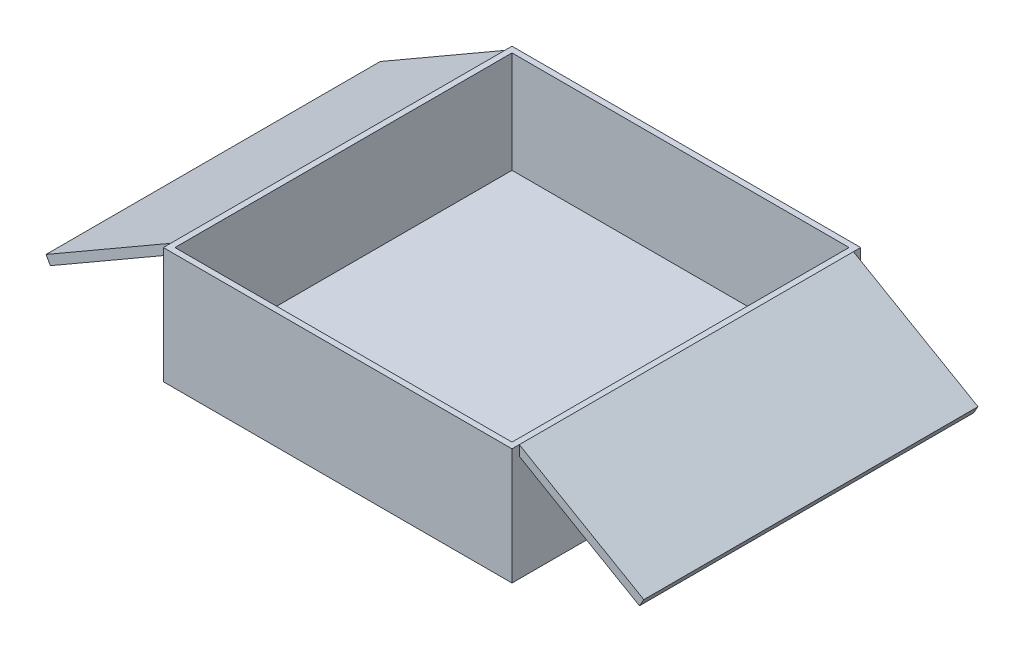
ISO-10303-21;
HEADER;
FILE_DESCRIPTION(('STEP AP214'),'2;1');
FILE_NAME('part.step','',(''),(''),'','','');
FILE_SCHEMA(('AUTOMOTIVE_DESIGN { 1 0 10303 214 1 1 1 1 }'));
ENDSEC;
DATA;
#1=APPLICATION_CONTEXT('core data for automotive mechanical design processes');
#2=APPLICATION_PROTOCOL_DEFINITION('international standard','automotive_design',2000,#1);
#3=PRODUCT_CONTEXT('',#1,'mechanical');
#4=PRODUCT('Part','Part','',(#3));
#5=PRODUCT_RELATED_PRODUCT_CATEGORY('part','',(#4));
#6=PRODUCT_DEFINITION_FORMATION('','',#4);
#7=PRODUCT_DEFINITION_CONTEXT('part definition',#1,'design');
#8=PRODUCT_DEFINITION('design','',#6,#7);
#9=PRODUCT_DEFINITION_SHAPE('','',#8);
#10=(LENGTH_UNIT() NAMED_UNIT(*) SI_UNIT(.MILLI.,.METRE.));
#11=(NAMED_UNIT(*) PLANE_ANGLE_UNIT() SI_UNIT($,.RADIAN.));
#12=(NAMED_UNIT(*) SI_UNIT($,.STERADIAN.) SOLID_ANGLE_UNIT());
#13=UNCERTAINTY_MEASURE_WITH_UNIT(LENGTH_MEASURE(1.E-05),#10,'distance_accuracy_value','');
#14=(GEOMETRIC_REPRESENTATION_CONTEXT(3) GLOBAL_UNCERTAINTY_ASSIGNED_CONTEXT((#13)) GLOBAL_UNIT_ASSIGNED_CONTEXT((#10,
#11,#12)) REPRESENTATION_CONTEXT('',''));
#15=CARTESIAN_POINT('',(0.,0.,0.));
#16=DIRECTION('',(0.,0.,1.));
#17=DIRECTION('',(1.,0.,0.));
#18=AXIS2_PLACEMENT_3D('',#15,#16,#17);
#19=CARTESIAN_POINT('',(-60.,5.,0.));
#20=DIRECTION('',(1.,0.,0.));
#21=DIRECTION('',(0.,0.,-1.));
#22=AXIS2_PLACEMENT_3D('',#19,#20,#21);
#23=PLANE('',#22);
#24=DIRECTION('',(0.,-1.,0.));
#25=VECTOR('',#24,1.);
#26=CARTESIAN_POINT('',(-60.,36.5358983848623,-57.5));
#27=LINE('',#26,#25);
#28=CARTESIAN_POINT('',(-60.,40.,-57.5));
#29=VERTEX_POINT('',#28);
#30=CARTESIAN_POINT('',(-60.,36.5358983848623,-57.5));
#31=VERTEX_POINT('',#30);
#32=EDGE_CURVE('E400',#29,#31,#27,.T.);
#33=ORIENTED_EDGE('',*,*,#32,.F.);
#34=DIRECTION('',(0.,0.,1.));
#35=VECTOR('',#34,1.);
#36=CARTESIAN_POINT('',(-60.,40.,-60.));
#37=LINE('',#36,#35);
#38=CARTESIAN_POINT('',(-60.,40.,-60.));
#39=VERTEX_POINT('',#38);
#40=EDGE_CURVE('E219',#39,#29,#37,.T.);
#41=ORIENTED_EDGE('',*,*,#40,.F.);
#42=DIRECTION('',(0.,-1.,0.));
#43=VECTOR('',#42,1.);
#44=CARTESIAN_POINT('',(-60.,5.,-60.));
#45=LINE('',#44,#43);
#46=CARTESIAN_POINT('',(-60.,0.,-60.));
#47=VERTEX_POINT('',#46);
#48=EDGE_CURVE('E336',#39,#47,#45,.T.);
#49=ORIENTED_EDGE('',*,*,#48,.T.);
#50=DIRECTION('',(0.,0.,1.));
#51=VECTOR('',#50,1.);
#52=CARTESIAN_POINT('',(-60.,0.,0.));
#53=LINE('',#52,#51);
#54=CARTESIAN_POINT('',(-60.,0.,60.));
#55=VERTEX_POINT('',#54);
#56=EDGE_CURVE('E324',#47,#55,#53,.T.);
#57=ORIENTED_EDGE('',*,*,#56,.T.);
#58=DIRECTION('',(0.,-1.,0.));
#59=VECTOR('',#58,1.);
#60=CARTESIAN_POINT('',(-60.,5.,60.));
#61=LINE('',#60,#59);
#62=CARTESIAN_POINT('',(-60.,40.,60.));
#63=VERTEX_POINT('',#62);
#64=EDGE_CURVE('E214',#63,#55,#61,.T.);
#65=ORIENTED_EDGE('',*,*,#64,.F.);
#66=CARTESIAN_POINT('',(-60.,40.,57.5));
#67=VERTEX_POINT('',#66);
#68=EDGE_CURVE('E210',#67,#63,#37,.T.);
#69=ORIENTED_EDGE('',*,*,#68,.F.);
#70=DIRECTION('',(0.,-1.,0.));
#71=VECTOR('',#70,1.);
#72=CARTESIAN_POINT('',(-60.,36.5358983848623,57.5));
#73=LINE('',#72,#71);
#74=CARTESIAN_POINT('',(-60.,36.5358983848623,57.5));
#75=VERTEX_POINT('',#74);
#76=EDGE_CURVE('E186',#67,#75,#73,.T.);
#77=ORIENTED_EDGE('',*,*,#76,.T.);
#78=DIRECTION('',(0.,0.,-1.));
#79=VECTOR('',#78,1.);
#80=CARTESIAN_POINT('',(-60.,36.5358983848623,57.5));
#81=LINE('',#80,#79);
#82=EDGE_CURVE('E401',#75,#31,#81,.T.);
#83=ORIENTED_EDGE('',*,*,#82,.T.);
#84=EDGE_LOOP('',(#33,#41,#49,#57,#65,#69,#77,#83));
#85=FACE_BOUND('',#84,.T.);
#86=ADVANCED_FACE('F71',(#85),#23,.F.);
#87=CARTESIAN_POINT('',(60.,5.,0.));
#88=DIRECTION('',(1.,0.,0.));
#89=DIRECTION('',(0.,0.,-1.));
#90=AXIS2_PLACEMENT_3D('',#87,#88,#89);
#91=PLANE('',#90);
#92=DIRECTION('',(0.,0.,-1.));
#93=VECTOR('',#92,1.);
#94=CARTESIAN_POINT('',(60.,40.,-60.));
#95=LINE('',#94,#93);
#96=CARTESIAN_POINT('',(60.,40.,-57.5));
#97=VERTEX_POINT('',#96);
#98=CARTESIAN_POINT('',(60.,40.,-60.));
#99=VERTEX_POINT('',#98);
#100=EDGE_CURVE('E306',#97,#99,#95,.T.);
#101=ORIENTED_EDGE('',*,*,#100,.F.);
#102=DIRECTION('',(0.,-1.,0.));
#103=VECTOR('',#102,1.);
#104=CARTESIAN_POINT('',(60.,36.5358983848623,-57.5));
#105=LINE('',#104,#103);
#106=CARTESIAN_POINT('',(60.,36.5358983848623,-57.5));
#107=VERTEX_POINT('',#106);
#108=EDGE_CURVE('E95',#97,#107,#105,.T.);
#109=ORIENTED_EDGE('',*,*,#108,.T.);
#110=DIRECTION('',(0.,0.,-1.));
#111=VECTOR('',#110,1.);
#112=CARTESIAN_POINT('',(60.,36.5358983848623,57.5));
#113=LINE('',#112,#111);
#114=CARTESIAN_POINT('',(60.,36.5358983848623,57.5));
#115=VERTEX_POINT('',#114);
#116=EDGE_CURVE('E273',#115,#107,#113,.T.);
#117=ORIENTED_EDGE('',*,*,#116,.F.);
#118=DIRECTION('',(0.,-1.,0.));
#119=VECTOR('',#118,1.);
#120=CARTESIAN_POINT('',(60.,36.5358983848623,57.5));
#121=LINE('',#120,#119);
#122=CARTESIAN_POINT('',(60.,40.,57.5));
#123=VERTEX_POINT('',#122);
#124=EDGE_CURVE('E238',#123,#115,#121,.T.);
#125=ORIENTED_EDGE('',*,*,#124,.F.);
#126=CARTESIAN_POINT('',(60.,40.,60.));
#127=VERTEX_POINT('',#126);
#128=EDGE_CURVE('E307',#127,#123,#95,.T.);
#129=ORIENTED_EDGE('',*,*,#128,.F.);
#130=DIRECTION('',(0.,-1.,0.));
#131=VECTOR('',#130,1.);
#132=CARTESIAN_POINT('',(60.,5.,60.));
#133=LINE('',#132,#131);
#134=CARTESIAN_POINT('',(60.,0.,60.));
#135=VERTEX_POINT('',#134);
#136=EDGE_CURVE('E331',#127,#135,#133,.T.);
#137=ORIENTED_EDGE('',*,*,#136,.T.);
#138=DIRECTION('',(0.,0.,1.));
#139=VECTOR('',#138,1.);
#140=CARTESIAN_POINT('',(60.,0.,0.));
#141=LINE('',#140,#139);
#142=CARTESIAN_POINT('',(60.,0.,-60.));
#143=VERTEX_POINT('',#142);
#144=EDGE_CURVE('E316',#143,#135,#141,.T.);
#145=ORIENTED_EDGE('',*,*,#144,.F.);
#146=DIRECTION('',(0.,-1.,0.));
#147=VECTOR('',#146,1.);
#148=CARTESIAN_POINT('',(60.,5.,-60.));
#149=LINE('',#148,#147);
#150=EDGE_CURVE('E339',#99,#143,#149,.T.);
#151=ORIENTED_EDGE('',*,*,#150,.F.);
#152=EDGE_LOOP('',(#101,#109,#117,#125,#129,#137,#145,#151));
#153=FACE_BOUND('',#152,.T.);
#154=ADVANCED_FACE('F73',(#153),#91,.T.);
#155=CARTESIAN_POINT('',(0.,5.,-60.));
#156=DIRECTION('',(0.,0.,-1.));
#157=DIRECTION('',(-1.,0.,0.));
#158=AXIS2_PLACEMENT_3D('',#155,#156,#157);
#159=PLANE('',#158);
#160=DIRECTION('',(1.,0.,0.));
#161=VECTOR('',#160,1.);
#162=CARTESIAN_POINT('',(0.,0.,-60.));
#163=LINE('',#162,#161);
#164=EDGE_CURVE('E320',#47,#143,#163,.T.);
#165=ORIENTED_EDGE('',*,*,#164,.F.);
#166=ORIENTED_EDGE('',*,*,#48,.F.);
#167=DIRECTION('',(-1.,0.,0.));
#168=VECTOR('',#167,1.);
#169=CARTESIAN_POINT('',(-60.,40.,-60.));
#170=LINE('',#169,#168);
#171=EDGE_CURVE('E220',#99,#39,#170,.T.);
#172=ORIENTED_EDGE('',*,*,#171,.F.);
#173=ORIENTED_EDGE('',*,*,#150,.T.);
#174=EDGE_LOOP('',(#165,#166,#172,#173));
#175=FACE_BOUND('',#174,.T.);
#176=ADVANCED_FACE('F383',(#175),#159,.T.);
#177=CARTESIAN_POINT('',(0.,5.,60.));
#178=DIRECTION('',(0.,0.,-1.));
#179=DIRECTION('',(-1.,0.,0.));
#180=AXIS2_PLACEMENT_3D('',#177,#178,#179);
#181=PLANE('',#180);
#182=DIRECTION('',(1.,0.,0.));
#183=VECTOR('',#182,1.);
#184=CARTESIAN_POINT('',(0.,0.,60.));
#185=LINE('',#184,#183);
#186=EDGE_CURVE('E327',#55,#135,#185,.T.);
#187=ORIENTED_EDGE('',*,*,#186,.T.);
#188=ORIENTED_EDGE('',*,*,#136,.F.);
#189=DIRECTION('',(1.,0.,0.));
#190=VECTOR('',#189,1.);
#191=CARTESIAN_POINT('',(-60.,40.,60.));
#192=LINE('',#191,#190);
#193=EDGE_CURVE('E313',#63,#127,#192,.T.);
#194=ORIENTED_EDGE('',*,*,#193,.F.);
#195=ORIENTED_EDGE('',*,*,#64,.T.);
#196=EDGE_LOOP('',(#187,#188,#194,#195));
#197=FACE_BOUND('',#196,.T.);
#198=ADVANCED_FACE('F385',(#197),#181,.F.);
#199=CARTESIAN_POINT('',(0.,0.,0.));
#200=DIRECTION('',(0.,1.,0.));
#201=DIRECTION('',(0.,0.,1.));
#202=AXIS2_PLACEMENT_3D('',#199,#200,#201);
#203=PLANE('',#202);
#204=ORIENTED_EDGE('',*,*,#144,.T.);
#205=ORIENTED_EDGE('',*,*,#186,.F.);
#206=ORIENTED_EDGE('',*,*,#56,.F.);
#207=ORIENTED_EDGE('',*,*,#164,.T.);
#208=EDGE_LOOP('',(#204,#205,#206,#207));
#209=FACE_BOUND('',#208,.T.);
#210=ADVANCED_FACE('F392',(#209),#203,.F.);
#211=CARTESIAN_POINT('',(0.,40.,0.));
#212=DIRECTION('',(0.,1.,0.));
#213=DIRECTION('',(0.,0.,1.));
#214=AXIS2_PLACEMENT_3D('',#211,#212,#213);
#215=PLANE('',#214);
#216=ORIENTED_EDGE('',*,*,#128,.T.);
#217=DIRECTION('',(0.,0.,-1.));
#218=VECTOR('',#217,1.);
#219=CARTESIAN_POINT('',(60.,40.,57.5));
#220=LINE('',#219,#218);
#221=EDGE_CURVE('E252',#123,#97,#220,.T.);
#222=ORIENTED_EDGE('',*,*,#221,.T.);
#223=ORIENTED_EDGE('',*,*,#100,.T.);
#224=ORIENTED_EDGE('',*,*,#171,.T.);
#225=ORIENTED_EDGE('',*,*,#40,.T.);
#226=DIRECTION('',(0.,0.,-1.));
#227=VECTOR('',#226,1.);
#228=CARTESIAN_POINT('',(-60.,40.,57.5));
#229=LINE('',#228,#227);
#230=EDGE_CURVE('E203',#67,#29,#229,.T.);
#231=ORIENTED_EDGE('',*,*,#230,.F.);
#232=ORIENTED_EDGE('',*,*,#68,.T.);
#233=ORIENTED_EDGE('',*,*,#193,.T.);
#234=EDGE_LOOP('',(#216,#222,#223,#224,#225,#231,#232,#233));
#235=FACE_BOUND('',#234,.T.);
#236=DIRECTION('',(1.,0.,0.));
#237=VECTOR('',#236,1.);
#238=CARTESIAN_POINT('',(-58.,40.,58.));
#239=LINE('',#238,#237);
#240=CARTESIAN_POINT('',(-58.,40.,58.));
#241=VERTEX_POINT('',#240);
#242=CARTESIAN_POINT('',(58.,40.,58.));
#243=VERTEX_POINT('',#242);
#244=EDGE_CURVE('E280',#241,#243,#239,.T.);
#245=ORIENTED_EDGE('',*,*,#244,.F.);
#246=DIRECTION('',(0.,0.,1.));
#247=VECTOR('',#246,1.);
#248=CARTESIAN_POINT('',(-58.,40.,-58.));
#249=LINE('',#248,#247);
#250=CARTESIAN_POINT('',(-58.,40.,-58.));
#251=VERTEX_POINT('',#250);
#252=EDGE_CURVE('E277',#251,#241,#249,.T.);
#253=ORIENTED_EDGE('',*,*,#252,.F.);
#254=DIRECTION('',(-1.,0.,0.));
#255=VECTOR('',#254,1.);
#256=CARTESIAN_POINT('',(-58.,40.,-58.));
#257=LINE('',#256,#255);
#258=CARTESIAN_POINT('',(58.,40.,-58.));
#259=VERTEX_POINT('',#258);
#260=EDGE_CURVE('E287',#259,#251,#257,.T.);
#261=ORIENTED_EDGE('',*,*,#260,.F.);
#262=DIRECTION('',(0.,0.,-1.));
#263=VECTOR('',#262,1.);
#264=CARTESIAN_POINT('',(58.,40.,-58.));
#265=LINE('',#264,#263);
#266=EDGE_CURVE('E283',#243,#259,#265,.T.);
#267=ORIENTED_EDGE('',*,*,#266,.F.);
#268=EDGE_LOOP('',(#245,#253,#261,#267));
#269=FACE_BOUND('',#268,.T.);
#270=ADVANCED_FACE('F224',(#235,#269),#215,.T.);
#271=CARTESIAN_POINT('',(-58.,40.,-58.));
#272=DIRECTION('',(1.,0.,0.));
#273=DIRECTION('',(0.,0.,-1.));
#274=AXIS2_PLACEMENT_3D('',#271,#272,#273);
#275=PLANE('',#274);
#276=DIRECTION('',(0.,-1.,0.));
#277=VECTOR('',#276,1.);
#278=CARTESIAN_POINT('',(-58.,40.,58.));
#279=LINE('',#278,#277);
#280=CARTESIAN_POINT('',(-58.,5.,58.));
#281=VERTEX_POINT('',#280);
#282=EDGE_CURVE('E302',#241,#281,#279,.T.);
#283=ORIENTED_EDGE('',*,*,#282,.T.);
#284=DIRECTION('',(0.,0.,-1.));
#285=VECTOR('',#284,1.);
#286=CARTESIAN_POINT('',(-58.,5.,0.));
#287=LINE('',#286,#285);
#288=CARTESIAN_POINT('',(-58.,5.,-58.));
#289=VERTEX_POINT('',#288);
#290=EDGE_CURVE('E12',#281,#289,#287,.T.);
#291=ORIENTED_EDGE('',*,*,#290,.T.);
#292=DIRECTION('',(0.,-1.,0.));
#293=VECTOR('',#292,1.);
#294=CARTESIAN_POINT('',(-58.,40.,-58.));
#295=LINE('',#294,#293);
#296=EDGE_CURVE('E290',#251,#289,#295,.T.);
#297=ORIENTED_EDGE('',*,*,#296,.F.);
#298=ORIENTED_EDGE('',*,*,#252,.T.);
#299=EDGE_LOOP('',(#283,#291,#297,#298));
#300=FACE_BOUND('',#299,.T.);
#301=ADVANCED_FACE('F358',(#300),#275,.T.);
#302=CARTESIAN_POINT('',(-58.,40.,58.));
#303=DIRECTION('',(0.,0.,-1.));
#304=DIRECTION('',(-1.,0.,0.));
#305=AXIS2_PLACEMENT_3D('',#302,#303,#304);
#306=PLANE('',#305);
#307=DIRECTION('',(0.,-1.,0.));
#308=VECTOR('',#307,1.);
#309=CARTESIAN_POINT('',(58.,40.,58.));
#310=LINE('',#309,#308);
#311=CARTESIAN_POINT('',(58.,5.,58.));
#312=VERTEX_POINT('',#311);
#313=EDGE_CURVE('E298',#243,#312,#310,.T.);
#314=ORIENTED_EDGE('',*,*,#313,.T.);
#315=DIRECTION('',(-1.,0.,0.));
#316=VECTOR('',#315,1.);
#317=CARTESIAN_POINT('',(0.,5.,58.));
#318=LINE('',#317,#316);
#319=EDGE_CURVE('E80',#312,#281,#318,.T.);
#320=ORIENTED_EDGE('',*,*,#319,.T.);
#321=ORIENTED_EDGE('',*,*,#282,.F.);
#322=ORIENTED_EDGE('',*,*,#244,.T.);
#323=EDGE_LOOP('',(#314,#320,#321,#322));
#324=FACE_BOUND('',#323,.T.);
#325=ADVANCED_FACE('F353',(#324),#306,.T.);
#326=CARTESIAN_POINT('',(58.,40.,-58.));
#327=DIRECTION('',(-1.,0.,0.));
#328=DIRECTION('',(0.,0.,1.));
#329=AXIS2_PLACEMENT_3D('',#326,#327,#328);
#330=PLANE('',#329);
#331=DIRECTION('',(0.,-1.,0.));
#332=VECTOR('',#331,1.);
#333=CARTESIAN_POINT('',(58.,40.,-58.));
#334=LINE('',#333,#332);
#335=CARTESIAN_POINT('',(58.,5.,-58.));
#336=VERTEX_POINT('',#335);
#337=EDGE_CURVE('E294',#259,#336,#334,.T.);
#338=ORIENTED_EDGE('',*,*,#337,.T.);
#339=DIRECTION('',(0.,0.,1.));
#340=VECTOR('',#339,1.);
#341=CARTESIAN_POINT('',(58.,5.,0.));
#342=LINE('',#341,#340);
#343=EDGE_CURVE('E346',#336,#312,#342,.T.);
#344=ORIENTED_EDGE('',*,*,#343,.T.);
#345=ORIENTED_EDGE('',*,*,#313,.F.);
#346=ORIENTED_EDGE('',*,*,#266,.T.);
#347=EDGE_LOOP('',(#338,#344,#345,#346));
#348=FACE_BOUND('',#347,.T.);
#349=ADVANCED_FACE('F364',(#348),#330,.T.);
#350=CARTESIAN_POINT('',(-58.,40.,-58.));
#351=DIRECTION('',(0.,0.,1.));
#352=DIRECTION('',(1.,0.,0.));
#353=AXIS2_PLACEMENT_3D('',#350,#351,#352);
#354=PLANE('',#353);
#355=ORIENTED_EDGE('',*,*,#296,.T.);
#356=DIRECTION('',(1.,0.,0.));
#357=VECTOR('',#356,1.);
#358=CARTESIAN_POINT('',(0.,5.,-58.));
#359=LINE('',#358,#357);
#360=EDGE_CURVE('E342',#289,#336,#359,.T.);
#361=ORIENTED_EDGE('',*,*,#360,.T.);
#362=ORIENTED_EDGE('',*,*,#337,.F.);
#363=ORIENTED_EDGE('',*,*,#260,.T.);
#364=EDGE_LOOP('',(#355,#361,#362,#363));
#365=FACE_BOUND('',#364,.T.);
#366=ADVANCED_FACE('F367',(#365),#354,.T.);
#367=CARTESIAN_POINT('',(0.,5.,0.));
#368=DIRECTION('',(0.,1.,0.));
#369=DIRECTION('',(0.,0.,1.));
#370=AXIS2_PLACEMENT_3D('',#367,#368,#369);
#371=PLANE('',#370);
#372=ORIENTED_EDGE('',*,*,#290,.F.);
#373=ORIENTED_EDGE('',*,*,#319,.F.);
#374=ORIENTED_EDGE('',*,*,#343,.F.);
#375=ORIENTED_EDGE('',*,*,#360,.F.);
#376=EDGE_LOOP('',(#372,#373,#374,#375));
#377=FACE_BOUND('',#376,.T.);
#378=ADVANCED_FACE('F365',(#377),#371,.T.);
#379=CARTESIAN_POINT('',(101.36825748733,12.6519237886468,57.5));
#380=DIRECTION('',(0.499999999999998,0.86602540378444,0.));
#381=DIRECTION('',(-0.86602540378444,0.499999999999998,0.));
#382=AXIS2_PLACEMENT_3D('',#379,#380,#381);
#383=PLANE('',#382);
#384=DIRECTION('',(0.86602540378444,-0.499999999999998,0.));
#385=VECTOR('',#384,1.);
#386=CARTESIAN_POINT('',(101.36825748733,12.6519237886468,-57.5));
#387=LINE('',#386,#385);
#388=CARTESIAN_POINT('',(101.36825748733,12.6519237886468,-57.5));
#389=VERTEX_POINT('',#388);
#390=EDGE_CURVE('E232',#107,#389,#387,.T.);
#391=ORIENTED_EDGE('',*,*,#390,.T.);
#392=DIRECTION('',(0.,0.,-1.));
#393=VECTOR('',#392,1.);
#394=CARTESIAN_POINT('',(101.36825748733,12.6519237886468,57.5));
#395=LINE('',#394,#393);
#396=CARTESIAN_POINT('',(101.36825748733,12.6519237886468,57.5));
#397=VERTEX_POINT('',#396);
#398=EDGE_CURVE('E269',#397,#389,#395,.T.);
#399=ORIENTED_EDGE('',*,*,#398,.F.);
#400=DIRECTION('',(0.86602540378444,-0.499999999999998,0.));
#401=VECTOR('',#400,1.);
#402=CARTESIAN_POINT('',(101.36825748733,12.6519237886468,57.5));
#403=LINE('',#402,#401);
#404=EDGE_CURVE('E242',#115,#397,#403,.T.);
#405=ORIENTED_EDGE('',*,*,#404,.F.);
#406=ORIENTED_EDGE('',*,*,#116,.T.);
#407=EDGE_LOOP('',(#391,#399,#405,#406));
#408=FACE_BOUND('',#407,.T.);
#409=ADVANCED_FACE('F374',(#408),#383,.F.);
#410=CARTESIAN_POINT('',(102.86825748733,15.2500000000001,57.5));
#411=DIRECTION('',(-0.86602540378444,0.499999999999997,0.));
#412=DIRECTION('',(-0.499999999999997,-0.86602540378444,0.));
#413=AXIS2_PLACEMENT_3D('',#410,#411,#412);
#414=PLANE('',#413);
#415=DIRECTION('',(0.499999999999997,0.86602540378444,0.));
#416=VECTOR('',#415,1.);
#417=CARTESIAN_POINT('',(102.86825748733,15.2500000000001,-57.5));
#418=LINE('',#417,#416);
#419=CARTESIAN_POINT('',(102.86825748733,15.2500000000001,-57.5));
#420=VERTEX_POINT('',#419);
#421=EDGE_CURVE('E256',#389,#420,#418,.T.);
#422=ORIENTED_EDGE('',*,*,#421,.T.);
#423=DIRECTION('',(0.,0.,-1.));
#424=VECTOR('',#423,1.);
#425=CARTESIAN_POINT('',(102.86825748733,15.2500000000001,57.5));
#426=LINE('',#425,#424);
#427=CARTESIAN_POINT('',(102.86825748733,15.2500000000001,57.5));
#428=VERTEX_POINT('',#427);
#429=EDGE_CURVE('E265',#428,#420,#426,.T.);
#430=ORIENTED_EDGE('',*,*,#429,.F.);
#431=DIRECTION('',(0.499999999999997,0.86602540378444,0.));
#432=VECTOR('',#431,1.);
#433=CARTESIAN_POINT('',(102.86825748733,15.2500000000001,57.5));
#434=LINE('',#433,#432);
#435=EDGE_CURVE('E246',#397,#428,#434,.T.);
#436=ORIENTED_EDGE('',*,*,#435,.F.);
#437=ORIENTED_EDGE('',*,*,#398,.T.);
#438=EDGE_LOOP('',(#422,#430,#436,#437));
#439=FACE_BOUND('',#438,.T.);
#440=ADVANCED_FACE('F448',(#439),#414,.F.);
#441=CARTESIAN_POINT('',(60.,40.,57.5));
#442=DIRECTION('',(-0.499999999999998,-0.86602540378444,0.));
#443=DIRECTION('',(0.86602540378444,-0.499999999999998,0.));
#444=AXIS2_PLACEMENT_3D('',#441,#442,#443);
#445=PLANE('',#444);
#446=DIRECTION('',(-0.86602540378444,0.499999999999998,0.));
#447=VECTOR('',#446,1.);
#448=CARTESIAN_POINT('',(60.,40.,-57.5));
#449=LINE('',#448,#447);
#450=EDGE_CURVE('E243',#420,#97,#449,.T.);
#451=ORIENTED_EDGE('',*,*,#450,.T.);
#452=ORIENTED_EDGE('',*,*,#221,.F.);
#453=DIRECTION('',(-0.86602540378444,0.499999999999998,0.));
#454=VECTOR('',#453,1.);
#455=CARTESIAN_POINT('',(60.,40.,57.5));
#456=LINE('',#455,#454);
#457=EDGE_CURVE('E249',#428,#123,#456,.T.);
#458=ORIENTED_EDGE('',*,*,#457,.F.);
#459=ORIENTED_EDGE('',*,*,#429,.T.);
#460=EDGE_LOOP('',(#451,#452,#458,#459));
#461=FACE_BOUND('',#460,.T.);
#462=ADVANCED_FACE('F441',(#461),#445,.F.);
#463=CARTESIAN_POINT('',(0.,0.,57.5));
#464=DIRECTION('',(0.,0.,-1.));
#465=DIRECTION('',(-1.,0.,0.));
#466=AXIS2_PLACEMENT_3D('',#463,#464,#465);
#467=PLANE('',#466);
#468=ORIENTED_EDGE('',*,*,#124,.T.);
#469=ORIENTED_EDGE('',*,*,#404,.T.);
#470=ORIENTED_EDGE('',*,*,#435,.T.);
#471=ORIENTED_EDGE('',*,*,#457,.T.);
#472=EDGE_LOOP('',(#468,#469,#470,#471));
#473=FACE_BOUND('',#472,.T.);
#474=ADVANCED_FACE('F438',(#473),#467,.F.);
#475=CARTESIAN_POINT('',(0.,0.,-57.5));
#476=DIRECTION('',(0.,0.,-1.));
#477=DIRECTION('',(-1.,0.,0.));
#478=AXIS2_PLACEMENT_3D('',#475,#476,#477);
#479=PLANE('',#478);
#480=ORIENTED_EDGE('',*,*,#108,.F.);
#481=ORIENTED_EDGE('',*,*,#450,.F.);
#482=ORIENTED_EDGE('',*,*,#421,.F.);
#483=ORIENTED_EDGE('',*,*,#390,.F.);
#484=EDGE_LOOP('',(#480,#481,#482,#483));
#485=FACE_BOUND('',#484,.T.);
#486=ADVANCED_FACE('F437',(#485),#479,.T.);
#487=CARTESIAN_POINT('',(-60.,40.,57.5));
#488=DIRECTION('',(-0.499999999999998,0.86602540378444,0.));
#489=DIRECTION('',(-0.86602540378444,-0.499999999999998,0.));
#490=AXIS2_PLACEMENT_3D('',#487,#488,#489);
#491=PLANE('',#490);
#492=DIRECTION('',(0.86602540378444,0.499999999999998,0.));
#493=VECTOR('',#492,1.);
#494=CARTESIAN_POINT('',(-60.,40.,-57.5));
#495=LINE('',#494,#493);
#496=CARTESIAN_POINT('',(-102.86825748733,15.2500000000001,-57.5));
#497=VERTEX_POINT('',#496);
#498=EDGE_CURVE('E404',#497,#29,#495,.T.);
#499=ORIENTED_EDGE('',*,*,#498,.F.);
#500=DIRECTION('',(0.,0.,-1.));
#501=VECTOR('',#500,1.);
#502=CARTESIAN_POINT('',(-102.86825748733,15.2500000000001,57.5));
#503=LINE('',#502,#501);
#504=CARTESIAN_POINT('',(-102.86825748733,15.2500000000001,57.5));
#505=VERTEX_POINT('',#504);
#506=EDGE_CURVE('E205',#505,#497,#503,.T.);
#507=ORIENTED_EDGE('',*,*,#506,.F.);
#508=DIRECTION('',(0.86602540378444,0.499999999999998,0.));
#509=VECTOR('',#508,1.);
#510=CARTESIAN_POINT('',(-60.,40.,57.5));
#511=LINE('',#510,#509);
#512=EDGE_CURVE('E190',#505,#67,#511,.T.);
#513=ORIENTED_EDGE('',*,*,#512,.T.);
#514=ORIENTED_EDGE('',*,*,#230,.T.);
#515=EDGE_LOOP('',(#499,#507,#513,#514));
#516=FACE_BOUND('',#515,.T.);
#517=ADVANCED_FACE('F201',(#516),#491,.T.);
#518=CARTESIAN_POINT('',(-102.86825748733,15.2500000000001,57.5));
#519=DIRECTION('',(-0.86602540378444,-0.499999999999997,0.));
#520=DIRECTION('',(0.499999999999997,-0.86602540378444,0.));
#521=AXIS2_PLACEMENT_3D('',#518,#519,#520);
#522=PLANE('',#521);
#523=DIRECTION('',(-0.499999999999997,0.86602540378444,0.));
#524=VECTOR('',#523,1.);
#525=CARTESIAN_POINT('',(-102.86825748733,15.2500000000001,-57.5));
#526=LINE('',#525,#524);
#527=CARTESIAN_POINT('',(-101.36825748733,12.6519237886468,-57.5));
#528=VERTEX_POINT('',#527);
#529=EDGE_CURVE('E407',#528,#497,#526,.T.);
#530=ORIENTED_EDGE('',*,*,#529,.F.);
#531=DIRECTION('',(0.,0.,-1.));
#532=VECTOR('',#531,1.);
#533=CARTESIAN_POINT('',(-101.36825748733,12.6519237886468,57.5));
#534=LINE('',#533,#532);
#535=CARTESIAN_POINT('',(-101.36825748733,12.6519237886468,57.5));
#536=VERTEX_POINT('',#535);
#537=EDGE_CURVE('E234',#536,#528,#534,.T.);
#538=ORIENTED_EDGE('',*,*,#537,.F.);
#539=DIRECTION('',(-0.499999999999997,0.86602540378444,0.));
#540=VECTOR('',#539,1.);
#541=CARTESIAN_POINT('',(-102.86825748733,15.2500000000001,57.5));
#542=LINE('',#541,#540);
#543=EDGE_CURVE('E207',#536,#505,#542,.T.);
#544=ORIENTED_EDGE('',*,*,#543,.T.);
#545=ORIENTED_EDGE('',*,*,#506,.T.);
#546=EDGE_LOOP('',(#530,#538,#544,#545));
#547=FACE_BOUND('',#546,.T.);
#548=ADVANCED_FACE('F422',(#547),#522,.T.);
#549=CARTESIAN_POINT('',(-101.36825748733,12.6519237886468,57.5));
#550=DIRECTION('',(0.499999999999998,-0.86602540378444,0.));
#551=DIRECTION('',(0.86602540378444,0.499999999999998,0.));
#552=AXIS2_PLACEMENT_3D('',#549,#550,#551);
#553=PLANE('',#552);
#554=DIRECTION('',(-0.86602540378444,-0.499999999999998,0.));
#555=VECTOR('',#554,1.);
#556=CARTESIAN_POINT('',(-101.36825748733,12.6519237886468,-57.5));
#557=LINE('',#556,#555);
#558=EDGE_CURVE('E87',#31,#528,#557,.T.);
#559=ORIENTED_EDGE('',*,*,#558,.F.);
#560=ORIENTED_EDGE('',*,*,#82,.F.);
#561=DIRECTION('',(-0.86602540378444,-0.499999999999998,0.));
#562=VECTOR('',#561,1.);
#563=CARTESIAN_POINT('',(-101.36825748733,12.6519237886468,57.5));
#564=LINE('',#563,#562);
#565=EDGE_CURVE('E193',#75,#536,#564,.T.);
#566=ORIENTED_EDGE('',*,*,#565,.T.);
#567=ORIENTED_EDGE('',*,*,#537,.T.);
#568=EDGE_LOOP('',(#559,#560,#566,#567));
#569=FACE_BOUND('',#568,.T.);
#570=ADVANCED_FACE('F420',(#569),#553,.T.);
#571=CARTESIAN_POINT('',(0.,0.,57.5));
#572=DIRECTION('',(0.,0.,-1.));
#573=DIRECTION('',(1.,0.,0.));
#574=AXIS2_PLACEMENT_3D('',#571,#572,#573);
#575=PLANE('',#574);
#576=ORIENTED_EDGE('',*,*,#76,.F.);
#577=ORIENTED_EDGE('',*,*,#512,.F.);
#578=ORIENTED_EDGE('',*,*,#543,.F.);
#579=ORIENTED_EDGE('',*,*,#565,.F.);
#580=EDGE_LOOP('',(#576,#577,#578,#579));
#581=FACE_BOUND('',#580,.T.);
#582=ADVANCED_FACE('F188',(#581),#575,.F.);
#583=CARTESIAN_POINT('',(0.,0.,-57.5));
#584=DIRECTION('',(0.,0.,-1.));
#585=DIRECTION('',(1.,0.,0.));
#586=AXIS2_PLACEMENT_3D('',#583,#584,#585);
#587=PLANE('',#586);
#588=ORIENTED_EDGE('',*,*,#32,.T.);
#589=ORIENTED_EDGE('',*,*,#558,.T.);
#590=ORIENTED_EDGE('',*,*,#529,.T.);
#591=ORIENTED_EDGE('',*,*,#498,.T.);
#592=EDGE_LOOP('',(#588,#589,#590,#591));
#593=FACE_BOUND('',#592,.T.);
#594=ADVANCED_FACE('F423',(#593),#587,.T.);
#595=CLOSED_SHELL('',(#86,#154,#176,#198,#210,#270,#301,#325,#349,#366,#378,#409,#440,#462,#474,
#486,#517,#548,#570,#582,#594));
#596=MANIFOLD_SOLID_BREP('B2',#595);
#597=ADVANCED_BREP_SHAPE_REPRESENTATION('',(#18,#596),#14);
#598=SHAPE_DEFINITION_REPRESENTATION(#9,#597);
ENDSEC;
END-ISO-10303-21;
